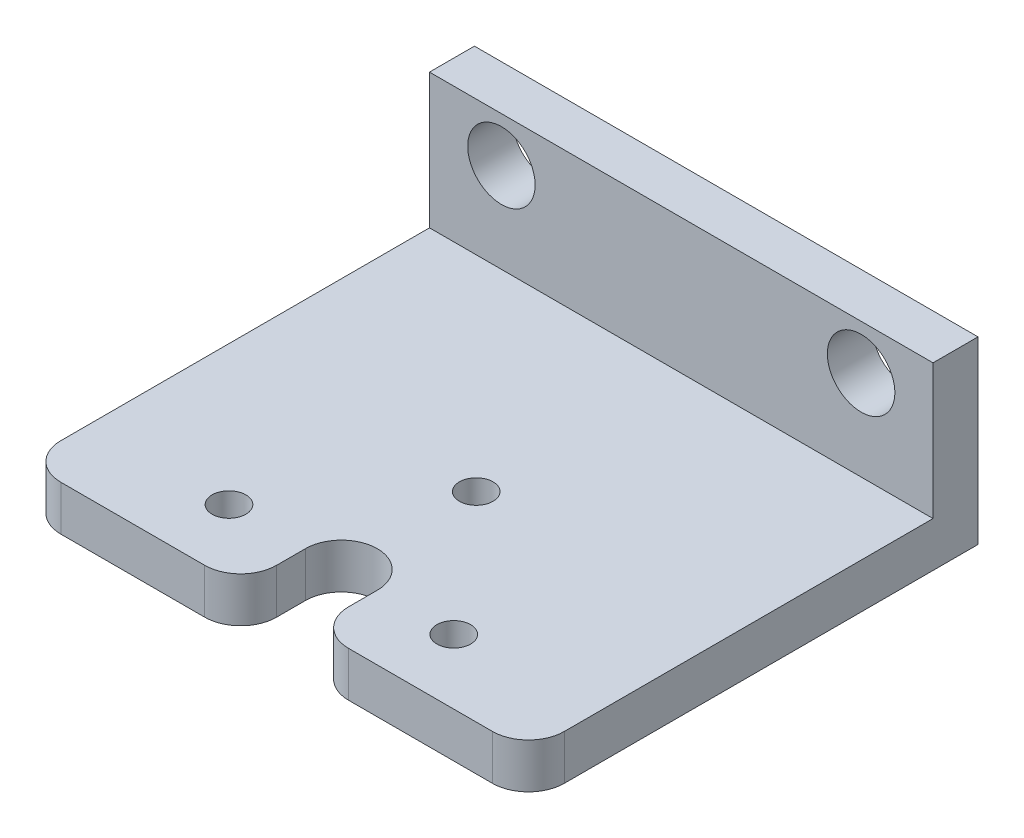
ISO-10303-21;
HEADER;
FILE_DESCRIPTION(('STEP AP214'),'2;1');
FILE_NAME('part.step','',(''),(''),'','','');
FILE_SCHEMA(('AUTOMOTIVE_DESIGN { 1 0 10303 214 1 1 1 1 }'));
ENDSEC;
DATA;
#1=APPLICATION_CONTEXT('core data for automotive mechanical design processes');
#2=APPLICATION_PROTOCOL_DEFINITION('international standard','automotive_design',2000,#1);
#3=PRODUCT_CONTEXT('',#1,'mechanical');
#4=PRODUCT('Part','Part','',(#3));
#5=PRODUCT_RELATED_PRODUCT_CATEGORY('part','',(#4));
#6=PRODUCT_DEFINITION_FORMATION('','',#4);
#7=PRODUCT_DEFINITION_CONTEXT('part definition',#1,'design');
#8=PRODUCT_DEFINITION('design','',#6,#7);
#9=PRODUCT_DEFINITION_SHAPE('','',#8);
#10=(LENGTH_UNIT() NAMED_UNIT(*) SI_UNIT(.MILLI.,.METRE.));
#11=(NAMED_UNIT(*) PLANE_ANGLE_UNIT() SI_UNIT($,.RADIAN.));
#12=(NAMED_UNIT(*) SI_UNIT($,.STERADIAN.) SOLID_ANGLE_UNIT());
#13=UNCERTAINTY_MEASURE_WITH_UNIT(LENGTH_MEASURE(1.E-05),#10,'distance_accuracy_value','');
#14=(GEOMETRIC_REPRESENTATION_CONTEXT(3) GLOBAL_UNCERTAINTY_ASSIGNED_CONTEXT((#13)) GLOBAL_UNIT_ASSIGNED_CONTEXT((#10,
#11,#12)) REPRESENTATION_CONTEXT('',''));
#15=CARTESIAN_POINT('',(0.,0.,0.));
#16=DIRECTION('',(0.,0.,1.));
#17=DIRECTION('',(1.,0.,0.));
#18=AXIS2_PLACEMENT_3D('',#15,#16,#17);
#19=CARTESIAN_POINT('',(0.,0.,31.75));
#20=DIRECTION('',(0.,0.,1.));
#21=DIRECTION('',(1.,0.,0.));
#22=AXIS2_PLACEMENT_3D('',#19,#20,#21);
#23=PLANE('',#22);
#24=DIRECTION('',(-1.,0.,0.));
#25=VECTOR('',#24,1.);
#26=CARTESIAN_POINT('',(-17.78,-3.17499999999999,31.75));
#27=LINE('',#26,#25);
#28=CARTESIAN_POINT('',(-5.08,-3.17499999999999,31.75));
#29=VERTEX_POINT('',#28);
#30=CARTESIAN_POINT('',(-15.24,-3.17499999999999,31.75));
#31=VERTEX_POINT('',#30);
#32=EDGE_CURVE('E174',#29,#31,#27,.T.);
#33=ORIENTED_EDGE('',*,*,#32,.T.);
#34=DIRECTION('',(0.,-1.,0.));
#35=VECTOR('',#34,1.);
#36=CARTESIAN_POINT('',(-15.24,-6.34999999999999,31.75));
#37=LINE('',#36,#35);
#38=CARTESIAN_POINT('',(-15.24,-6.34999999999999,31.75));
#39=VERTEX_POINT('',#38);
#40=EDGE_CURVE('E344',#31,#39,#37,.T.);
#41=ORIENTED_EDGE('',*,*,#40,.T.);
#42=DIRECTION('',(1.,0.,0.));
#43=VECTOR('',#42,1.);
#44=CARTESIAN_POINT('',(-17.78,-6.34999999999999,31.75));
#45=LINE('',#44,#43);
#46=CARTESIAN_POINT('',(-5.08,-6.34999999999999,31.75));
#47=VERTEX_POINT('',#46);
#48=EDGE_CURVE('E177',#39,#47,#45,.T.);
#49=ORIENTED_EDGE('',*,*,#48,.T.);
#50=DIRECTION('',(0.,-1.,0.));
#51=VECTOR('',#50,1.);
#52=CARTESIAN_POINT('',(-5.08,-3.17499999999999,31.75));
#53=LINE('',#52,#51);
#54=EDGE_CURVE('E347',#47,#29,#53,.F.);
#55=ORIENTED_EDGE('',*,*,#54,.T.);
#56=EDGE_LOOP('',(#33,#41,#49,#55));
#57=FACE_BOUND('',#56,.T.);
#58=ADVANCED_FACE('F35',(#57),#23,.T.);
#59=CARTESIAN_POINT('',(0.,0.,3.175));
#60=DIRECTION('',(0.,0.,1.));
#61=DIRECTION('',(1.,0.,0.));
#62=AXIS2_PLACEMENT_3D('',#59,#60,#61);
#63=PLANE('',#62);
#64=DIRECTION('',(-1.,0.,0.));
#65=VECTOR('',#64,1.);
#66=CARTESIAN_POINT('',(-17.78,-3.17499999999999,3.175));
#67=LINE('',#66,#65);
#68=CARTESIAN_POINT('',(17.78,-3.17499999999999,3.175));
#69=VERTEX_POINT('',#68);
#70=CARTESIAN_POINT('',(-17.78,-3.17499999999999,3.175));
#71=VERTEX_POINT('',#70);
#72=EDGE_CURVE('E170',#69,#71,#67,.T.);
#73=ORIENTED_EDGE('',*,*,#72,.F.);
#74=DIRECTION('',(0.,1.,0.));
#75=VECTOR('',#74,1.);
#76=CARTESIAN_POINT('',(17.78,6.35000000000001,3.175));
#77=LINE('',#76,#75);
#78=CARTESIAN_POINT('',(17.78,6.35000000000001,3.175));
#79=VERTEX_POINT('',#78);
#80=EDGE_CURVE('E307',#69,#79,#77,.T.);
#81=ORIENTED_EDGE('',*,*,#80,.T.);
#82=DIRECTION('',(-1.,0.,0.));
#83=VECTOR('',#82,1.);
#84=CARTESIAN_POINT('',(-17.78,6.35,3.175));
#85=LINE('',#84,#83);
#86=CARTESIAN_POINT('',(-17.78,6.35,3.175));
#87=VERTEX_POINT('',#86);
#88=EDGE_CURVE('E298',#79,#87,#85,.T.);
#89=ORIENTED_EDGE('',*,*,#88,.T.);
#90=DIRECTION('',(0.,-1.,0.));
#91=VECTOR('',#90,1.);
#92=CARTESIAN_POINT('',(-17.78,6.35,3.175));
#93=LINE('',#92,#91);
#94=EDGE_CURVE('E186',#87,#71,#93,.T.);
#95=ORIENTED_EDGE('',*,*,#94,.T.);
#96=EDGE_LOOP('',(#73,#81,#89,#95));
#97=FACE_BOUND('',#96,.T.);
#98=CARTESIAN_POINT('',(-12.7,3.175,3.175));
#99=DIRECTION('',(0.,0.,1.));
#100=DIRECTION('',(1.,0.,0.));
#101=AXIS2_PLACEMENT_3D('',#98,#99,#100);
#102=CIRCLE('',#101,2.38125);
#103=CARTESIAN_POINT('',(-10.31875,3.175,3.175));
#104=VERTEX_POINT('',#103);
#105=EDGE_CURVE('E319',#104,#104,#102,.T.);
#106=ORIENTED_EDGE('',*,*,#105,.F.);
#107=EDGE_LOOP('',(#106));
#108=FACE_BOUND('',#107,.T.);
#109=CARTESIAN_POINT('',(12.7,3.175,3.175));
#110=DIRECTION('',(0.,0.,1.));
#111=DIRECTION('',(-1.,0.,0.));
#112=AXIS2_PLACEMENT_3D('',#109,#110,#111);
#113=CIRCLE('',#112,2.38125);
#114=CARTESIAN_POINT('',(10.31875,3.175,3.175));
#115=VERTEX_POINT('',#114);
#116=EDGE_CURVE('E180',#115,#115,#113,.T.);
#117=ORIENTED_EDGE('',*,*,#116,.F.);
#118=EDGE_LOOP('',(#117));
#119=FACE_BOUND('',#118,.T.);
#120=ADVANCED_FACE('F253',(#97,#108,#119),#63,.T.);
#121=CARTESIAN_POINT('',(0.,0.,0.));
#122=DIRECTION('',(0.,0.,1.));
#123=DIRECTION('',(1.,0.,0.));
#124=AXIS2_PLACEMENT_3D('',#121,#122,#123);
#125=PLANE('',#124);
#126=DIRECTION('',(0.,1.,0.));
#127=VECTOR('',#126,1.);
#128=CARTESIAN_POINT('',(17.78,6.35000000000001,0.));
#129=LINE('',#128,#127);
#130=CARTESIAN_POINT('',(17.78,-6.34999999999999,0.));
#131=VERTEX_POINT('',#130);
#132=CARTESIAN_POINT('',(17.78,6.35000000000001,0.));
#133=VERTEX_POINT('',#132);
#134=EDGE_CURVE('E316',#131,#133,#129,.T.);
#135=ORIENTED_EDGE('',*,*,#134,.F.);
#136=DIRECTION('',(1.,0.,0.));
#137=VECTOR('',#136,1.);
#138=CARTESIAN_POINT('',(-17.78,-6.35,0.));
#139=LINE('',#138,#137);
#140=CARTESIAN_POINT('',(-17.78,-6.35,0.));
#141=VERTEX_POINT('',#140);
#142=EDGE_CURVE('E291',#141,#131,#139,.T.);
#143=ORIENTED_EDGE('',*,*,#142,.F.);
#144=DIRECTION('',(0.,-1.,0.));
#145=VECTOR('',#144,1.);
#146=CARTESIAN_POINT('',(-17.78,6.35,0.));
#147=LINE('',#146,#145);
#148=CARTESIAN_POINT('',(-17.78,6.35,0.));
#149=VERTEX_POINT('',#148);
#150=EDGE_CURVE('E320',#149,#141,#147,.T.);
#151=ORIENTED_EDGE('',*,*,#150,.F.);
#152=DIRECTION('',(-1.,0.,0.));
#153=VECTOR('',#152,1.);
#154=CARTESIAN_POINT('',(-17.78,6.35,0.));
#155=LINE('',#154,#153);
#156=EDGE_CURVE('E318',#133,#149,#155,.T.);
#157=ORIENTED_EDGE('',*,*,#156,.F.);
#158=EDGE_LOOP('',(#135,#143,#151,#157));
#159=FACE_BOUND('',#158,.T.);
#160=CARTESIAN_POINT('',(-12.7,3.175,0.));
#161=DIRECTION('',(0.,0.,1.));
#162=DIRECTION('',(1.,0.,0.));
#163=AXIS2_PLACEMENT_3D('',#160,#161,#162);
#164=CIRCLE('',#163,2.38125);
#165=CARTESIAN_POINT('',(-10.31875,3.175,0.));
#166=VERTEX_POINT('',#165);
#167=EDGE_CURVE('E312',#166,#166,#164,.T.);
#168=ORIENTED_EDGE('',*,*,#167,.T.);
#169=EDGE_LOOP('',(#168));
#170=FACE_BOUND('',#169,.T.);
#171=CARTESIAN_POINT('',(12.7,3.175,0.));
#172=DIRECTION('',(0.,0.,1.));
#173=DIRECTION('',(-1.,0.,0.));
#174=AXIS2_PLACEMENT_3D('',#171,#172,#173);
#175=CIRCLE('',#174,2.38125);
#176=CARTESIAN_POINT('',(10.31875,3.175,0.));
#177=VERTEX_POINT('',#176);
#178=EDGE_CURVE('E204',#177,#177,#175,.T.);
#179=ORIENTED_EDGE('',*,*,#178,.T.);
#180=EDGE_LOOP('',(#179));
#181=FACE_BOUND('',#180,.T.);
#182=ADVANCED_FACE('F260',(#159,#170,#181),#125,.F.);
#183=CARTESIAN_POINT('',(17.78,6.35000000000001,3.175));
#184=DIRECTION('',(-1.,0.,0.));
#185=DIRECTION('',(0.,-1.,0.));
#186=AXIS2_PLACEMENT_3D('',#183,#184,#185);
#187=PLANE('',#186);
#188=DIRECTION('',(0.,0.,-1.));
#189=VECTOR('',#188,1.);
#190=CARTESIAN_POINT('',(17.78,-3.17499999999999,31.75));
#191=LINE('',#190,#189);
#192=CARTESIAN_POINT('',(17.78,-3.17499999999999,29.21));
#193=VERTEX_POINT('',#192);
#194=EDGE_CURVE('E197',#193,#69,#191,.T.);
#195=ORIENTED_EDGE('',*,*,#194,.F.);
#196=DIRECTION('',(0.,1.,0.));
#197=VECTOR('',#196,1.);
#198=CARTESIAN_POINT('',(17.78,-6.34999999999999,29.21));
#199=LINE('',#198,#197);
#200=CARTESIAN_POINT('',(17.78,-6.34999999999999,29.21));
#201=VERTEX_POINT('',#200);
#202=EDGE_CURVE('E215',#193,#201,#199,.F.);
#203=ORIENTED_EDGE('',*,*,#202,.T.);
#204=DIRECTION('',(0.,0.,-1.));
#205=VECTOR('',#204,1.);
#206=CARTESIAN_POINT('',(17.78,-6.34999999999999,3.175));
#207=LINE('',#206,#205);
#208=EDGE_CURVE('E287',#201,#131,#207,.T.);
#209=ORIENTED_EDGE('',*,*,#208,.T.);
#210=ORIENTED_EDGE('',*,*,#134,.T.);
#211=DIRECTION('',(0.,0.,-1.));
#212=VECTOR('',#211,1.);
#213=CARTESIAN_POINT('',(17.78,6.35000000000001,3.175));
#214=LINE('',#213,#212);
#215=EDGE_CURVE('E304',#79,#133,#214,.T.);
#216=ORIENTED_EDGE('',*,*,#215,.F.);
#217=ORIENTED_EDGE('',*,*,#80,.F.);
#218=EDGE_LOOP('',(#195,#203,#209,#210,#216,#217));
#219=FACE_BOUND('',#218,.T.);
#220=ADVANCED_FACE('F285',(#219),#187,.F.);
#221=CARTESIAN_POINT('',(-17.78,6.35,3.175));
#222=DIRECTION('',(0.,-1.,0.));
#223=DIRECTION('',(1.,0.,0.));
#224=AXIS2_PLACEMENT_3D('',#221,#222,#223);
#225=PLANE('',#224);
#226=ORIENTED_EDGE('',*,*,#156,.T.);
#227=DIRECTION('',(0.,0.,-1.));
#228=VECTOR('',#227,1.);
#229=CARTESIAN_POINT('',(-17.78,6.35,3.175));
#230=LINE('',#229,#228);
#231=EDGE_CURVE('E295',#87,#149,#230,.T.);
#232=ORIENTED_EDGE('',*,*,#231,.F.);
#233=ORIENTED_EDGE('',*,*,#88,.F.);
#234=ORIENTED_EDGE('',*,*,#215,.T.);
#235=EDGE_LOOP('',(#226,#232,#233,#234));
#236=FACE_BOUND('',#235,.T.);
#237=ADVANCED_FACE('F334',(#236),#225,.F.);
#238=CARTESIAN_POINT('',(-17.78,6.35,3.175));
#239=DIRECTION('',(1.,0.,0.));
#240=DIRECTION('',(0.,1.,0.));
#241=AXIS2_PLACEMENT_3D('',#238,#239,#240);
#242=PLANE('',#241);
#243=DIRECTION('',(0.,0.,-1.));
#244=VECTOR('',#243,1.);
#245=CARTESIAN_POINT('',(-17.78,-6.35,3.175));
#246=LINE('',#245,#244);
#247=CARTESIAN_POINT('',(-17.78,-6.35,29.21));
#248=VERTEX_POINT('',#247);
#249=EDGE_CURVE('E293',#248,#141,#246,.T.);
#250=ORIENTED_EDGE('',*,*,#249,.F.);
#251=DIRECTION('',(0.,-1.,0.));
#252=VECTOR('',#251,1.);
#253=CARTESIAN_POINT('',(-17.78,-3.17499999999999,29.21));
#254=LINE('',#253,#252);
#255=CARTESIAN_POINT('',(-17.78,-3.17499999999999,29.21));
#256=VERTEX_POINT('',#255);
#257=EDGE_CURVE('E200',#248,#256,#254,.F.);
#258=ORIENTED_EDGE('',*,*,#257,.T.);
#259=DIRECTION('',(0.,0.,-1.));
#260=VECTOR('',#259,1.);
#261=CARTESIAN_POINT('',(-17.78,-3.17499999999999,31.75));
#262=LINE('',#261,#260);
#263=EDGE_CURVE('E194',#256,#71,#262,.T.);
#264=ORIENTED_EDGE('',*,*,#263,.T.);
#265=ORIENTED_EDGE('',*,*,#94,.F.);
#266=ORIENTED_EDGE('',*,*,#231,.T.);
#267=ORIENTED_EDGE('',*,*,#150,.T.);
#268=EDGE_LOOP('',(#250,#258,#264,#265,#266,#267));
#269=FACE_BOUND('',#268,.T.);
#270=ADVANCED_FACE('F325',(#269),#242,.F.);
#271=CARTESIAN_POINT('',(-17.78,-6.35,3.175));
#272=DIRECTION('',(0.,1.,0.));
#273=DIRECTION('',(-1.,0.,0.));
#274=AXIS2_PLACEMENT_3D('',#271,#272,#273);
#275=PLANE('',#274);
#276=CARTESIAN_POINT('',(7.9375,-6.34999999999999,27.178));
#277=DIRECTION('',(0.,1.,0.));
#278=DIRECTION('',(-1.,0.,0.));
#279=AXIS2_PLACEMENT_3D('',#276,#277,#278);
#280=CIRCLE('',#279,2.46062500000001);
#281=CARTESIAN_POINT('',(5.47687499999999,-6.34999999999999,27.178));
#282=VERTEX_POINT('',#281);
#283=EDGE_CURVE('E231',#282,#282,#280,.T.);
#284=ORIENTED_EDGE('',*,*,#283,.T.);
#285=EDGE_LOOP('',(#284));
#286=FACE_BOUND('',#285,.T.);
#287=CARTESIAN_POINT('',(0.,-6.34999999999999,17.653));
#288=DIRECTION('',(0.,1.,0.));
#289=DIRECTION('',(-1.,0.,0.));
#290=AXIS2_PLACEMENT_3D('',#287,#288,#289);
#291=CIRCLE('',#290,2.46062500000001);
#292=CARTESIAN_POINT('',(-2.46062500000001,-6.34999999999999,17.653));
#293=VERTEX_POINT('',#292);
#294=EDGE_CURVE('E228',#293,#293,#291,.T.);
#295=ORIENTED_EDGE('',*,*,#294,.T.);
#296=EDGE_LOOP('',(#295));
#297=FACE_BOUND('',#296,.T.);
#298=CARTESIAN_POINT('',(-7.9375,-6.34999999999999,27.178));
#299=DIRECTION('',(0.,1.,0.));
#300=DIRECTION('',(-1.,0.,0.));
#301=AXIS2_PLACEMENT_3D('',#298,#299,#300);
#302=CIRCLE('',#301,2.46062500000001);
#303=CARTESIAN_POINT('',(-10.398125,-6.34999999999999,27.178));
#304=VERTEX_POINT('',#303);
#305=EDGE_CURVE('E225',#304,#304,#302,.T.);
#306=ORIENTED_EDGE('',*,*,#305,.T.);
#307=EDGE_LOOP('',(#306));
#308=FACE_BOUND('',#307,.T.);
#309=ORIENTED_EDGE('',*,*,#48,.F.);
#310=CARTESIAN_POINT('',(-15.24,-6.35,29.21));
#311=DIRECTION('',(0.,1.,0.));
#312=DIRECTION('',(-1.,0.,0.));
#313=AXIS2_PLACEMENT_3D('',#310,#311,#312);
#314=CIRCLE('',#313,2.54);
#315=EDGE_CURVE('E198',#39,#248,#314,.F.);
#316=ORIENTED_EDGE('',*,*,#315,.T.);
#317=ORIENTED_EDGE('',*,*,#249,.T.);
#318=ORIENTED_EDGE('',*,*,#142,.T.);
#319=ORIENTED_EDGE('',*,*,#208,.F.);
#320=CARTESIAN_POINT('',(15.24,-6.34999999999999,29.21));
#321=DIRECTION('',(0.,1.,0.));
#322=DIRECTION('',(-1.,0.,0.));
#323=AXIS2_PLACEMENT_3D('',#320,#321,#322);
#324=CIRCLE('',#323,2.54);
#325=CARTESIAN_POINT('',(15.24,-6.34999999999999,31.75));
#326=VERTEX_POINT('',#325);
#327=EDGE_CURVE('E282',#201,#326,#324,.F.);
#328=ORIENTED_EDGE('',*,*,#327,.T.);
#329=CARTESIAN_POINT('',(5.08,-6.34999999999999,31.75));
#330=VERTEX_POINT('',#329);
#331=EDGE_CURVE('E173',#330,#326,#45,.T.);
#332=ORIENTED_EDGE('',*,*,#331,.F.);
#333=CARTESIAN_POINT('',(5.08,-6.34999999999999,29.21));
#334=DIRECTION('',(0.,1.,0.));
#335=DIRECTION('',(-1.,0.,0.));
#336=AXIS2_PLACEMENT_3D('',#333,#334,#335);
#337=CIRCLE('',#336,2.54);
#338=CARTESIAN_POINT('',(2.54,-6.34999999999999,29.21));
#339=VERTEX_POINT('',#338);
#340=EDGE_CURVE('E162',#330,#339,#337,.F.);
#341=ORIENTED_EDGE('',*,*,#340,.T.);
#342=DIRECTION('',(0.,0.,1.));
#343=VECTOR('',#342,1.);
#344=CARTESIAN_POINT('',(2.54,-6.34999999999999,48.2617809076499));
#345=LINE('',#344,#343);
#346=CARTESIAN_POINT('',(2.54,-6.34999999999999,27.178));
#347=VERTEX_POINT('',#346);
#348=EDGE_CURVE('E140',#347,#339,#345,.T.);
#349=ORIENTED_EDGE('',*,*,#348,.F.);
#350=CARTESIAN_POINT('',(0.,-6.34999999999999,27.178));
#351=DIRECTION('',(0.,-1.,0.));
#352=DIRECTION('',(1.,0.,0.));
#353=AXIS2_PLACEMENT_3D('',#350,#351,#352);
#354=CIRCLE('',#353,2.54);
#355=CARTESIAN_POINT('',(-2.54,-6.34999999999999,27.178));
#356=VERTEX_POINT('',#355);
#357=EDGE_CURVE('E151',#356,#347,#354,.T.);
#358=ORIENTED_EDGE('',*,*,#357,.F.);
#359=DIRECTION('',(0.,0.,-1.));
#360=VECTOR('',#359,1.);
#361=CARTESIAN_POINT('',(-2.54,-6.34999999999999,48.2617809076499));
#362=LINE('',#361,#360);
#363=CARTESIAN_POINT('',(-2.54,-6.34999999999999,29.21));
#364=VERTEX_POINT('',#363);
#365=EDGE_CURVE('E147',#364,#356,#362,.T.);
#366=ORIENTED_EDGE('',*,*,#365,.F.);
#367=CARTESIAN_POINT('',(-5.08,-6.34999999999999,29.21));
#368=DIRECTION('',(0.,1.,0.));
#369=DIRECTION('',(-1.,0.,0.));
#370=AXIS2_PLACEMENT_3D('',#367,#368,#369);
#371=CIRCLE('',#370,2.54);
#372=EDGE_CURVE('E346',#364,#47,#371,.F.);
#373=ORIENTED_EDGE('',*,*,#372,.T.);
#374=EDGE_LOOP('',(#309,#316,#317,#318,#319,#328,#332,#341,#349,#358,#366,#373));
#375=FACE_BOUND('',#374,.T.);
#376=ADVANCED_FACE('F159',(#286,#297,#308,#375),#275,.F.);
#377=CARTESIAN_POINT('',(-12.7,3.175,3.175));
#378=DIRECTION('',(0.,0.,-1.));
#379=DIRECTION('',(-1.,0.,0.));
#380=AXIS2_PLACEMENT_3D('',#377,#378,#379);
#381=CYLINDRICAL_SURFACE('',#380,2.38125);
#382=ORIENTED_EDGE('',*,*,#105,.T.);
#383=EDGE_LOOP('',(#382));
#384=FACE_BOUND('',#383,.T.);
#385=ORIENTED_EDGE('',*,*,#167,.F.);
#386=EDGE_LOOP('',(#385));
#387=FACE_BOUND('',#386,.T.);
#388=ADVANCED_FACE('F435',(#384,#387),#381,.F.);
#389=CARTESIAN_POINT('',(12.7,3.175,3.175));
#390=DIRECTION('',(0.,0.,-1.));
#391=DIRECTION('',(-1.,0.,0.));
#392=AXIS2_PLACEMENT_3D('',#389,#390,#391);
#393=CYLINDRICAL_SURFACE('',#392,2.38125);
#394=ORIENTED_EDGE('',*,*,#116,.T.);
#395=EDGE_LOOP('',(#394));
#396=FACE_BOUND('',#395,.T.);
#397=ORIENTED_EDGE('',*,*,#178,.F.);
#398=EDGE_LOOP('',(#397));
#399=FACE_BOUND('',#398,.T.);
#400=ADVANCED_FACE('F274',(#396,#399),#393,.F.);
#401=CARTESIAN_POINT('',(-17.78,-3.17499999999999,31.75));
#402=DIRECTION('',(0.,-1.,0.));
#403=DIRECTION('',(0.,0.,-1.));
#404=AXIS2_PLACEMENT_3D('',#401,#402,#403);
#405=PLANE('',#404);
#406=CARTESIAN_POINT('',(0.,-3.17499999999999,17.653));
#407=DIRECTION('',(0.,-1.,0.));
#408=DIRECTION('',(0.,0.,-1.));
#409=AXIS2_PLACEMENT_3D('',#406,#407,#408);
#410=CIRCLE('',#409,1.190625);
#411=CARTESIAN_POINT('',(0.,-3.17499999999999,16.462375));
#412=VERTEX_POINT('',#411);
#413=EDGE_CURVE('E573',#412,#412,#410,.T.);
#414=ORIENTED_EDGE('',*,*,#413,.T.);
#415=EDGE_LOOP('',(#414));
#416=FACE_BOUND('',#415,.T.);
#417=CARTESIAN_POINT('',(7.9375,-3.17499999999999,27.178));
#418=DIRECTION('',(0.,-1.,0.));
#419=DIRECTION('',(0.,0.,-1.));
#420=AXIS2_PLACEMENT_3D('',#417,#418,#419);
#421=CIRCLE('',#420,1.190625);
#422=CARTESIAN_POINT('',(7.9375,-3.17499999999999,25.987375));
#423=VERTEX_POINT('',#422);
#424=EDGE_CURVE('E570',#423,#423,#421,.T.);
#425=ORIENTED_EDGE('',*,*,#424,.T.);
#426=EDGE_LOOP('',(#425));
#427=FACE_BOUND('',#426,.T.);
#428=CARTESIAN_POINT('',(-7.9375,-3.17499999999999,27.178));
#429=DIRECTION('',(0.,-1.,0.));
#430=DIRECTION('',(0.,0.,-1.));
#431=AXIS2_PLACEMENT_3D('',#428,#429,#430);
#432=CIRCLE('',#431,1.190625);
#433=CARTESIAN_POINT('',(-7.9375,-3.17499999999999,25.987375));
#434=VERTEX_POINT('',#433);
#435=EDGE_CURVE('E156',#434,#434,#432,.T.);
#436=ORIENTED_EDGE('',*,*,#435,.T.);
#437=EDGE_LOOP('',(#436));
#438=FACE_BOUND('',#437,.T.);
#439=ORIENTED_EDGE('',*,*,#263,.F.);
#440=CARTESIAN_POINT('',(-15.24,-3.17499999999999,29.21));
#441=DIRECTION('',(0.,-1.,0.));
#442=DIRECTION('',(0.,0.,-1.));
#443=AXIS2_PLACEMENT_3D('',#440,#441,#442);
#444=CIRCLE('',#443,2.54);
#445=EDGE_CURVE('E208',#256,#31,#444,.F.);
#446=ORIENTED_EDGE('',*,*,#445,.T.);
#447=ORIENTED_EDGE('',*,*,#32,.F.);
#448=CARTESIAN_POINT('',(-5.08,-3.17499999999999,29.21));
#449=DIRECTION('',(0.,-1.,0.));
#450=DIRECTION('',(0.,0.,-1.));
#451=AXIS2_PLACEMENT_3D('',#448,#449,#450);
#452=CIRCLE('',#451,2.54);
#453=CARTESIAN_POINT('',(-2.54,-3.17499999999999,29.21));
#454=VERTEX_POINT('',#453);
#455=EDGE_CURVE('E202',#29,#454,#452,.F.);
#456=ORIENTED_EDGE('',*,*,#455,.T.);
#457=DIRECTION('',(0.,0.,-1.));
#458=VECTOR('',#457,1.);
#459=CARTESIAN_POINT('',(-2.54,-3.17499999999999,31.75));
#460=LINE('',#459,#458);
#461=CARTESIAN_POINT('',(-2.54,-3.17499999999999,27.178));
#462=VERTEX_POINT('',#461);
#463=EDGE_CURVE('E168',#454,#462,#460,.T.);
#464=ORIENTED_EDGE('',*,*,#463,.T.);
#465=CARTESIAN_POINT('',(0.,-3.17499999999999,27.178));
#466=DIRECTION('',(0.,-1.,0.));
#467=DIRECTION('',(0.,0.,-1.));
#468=AXIS2_PLACEMENT_3D('',#465,#466,#467);
#469=CIRCLE('',#468,2.54);
#470=CARTESIAN_POINT('',(2.54,-3.17499999999999,27.178));
#471=VERTEX_POINT('',#470);
#472=EDGE_CURVE('E306',#462,#471,#469,.T.);
#473=ORIENTED_EDGE('',*,*,#472,.T.);
#474=DIRECTION('',(0.,0.,1.));
#475=VECTOR('',#474,1.);
#476=CARTESIAN_POINT('',(2.54,-3.17499999999999,31.75));
#477=LINE('',#476,#475);
#478=CARTESIAN_POINT('',(2.54,-3.17499999999999,29.21));
#479=VERTEX_POINT('',#478);
#480=EDGE_CURVE('E142',#471,#479,#477,.T.);
#481=ORIENTED_EDGE('',*,*,#480,.T.);
#482=CARTESIAN_POINT('',(5.08,-3.17499999999999,29.21));
#483=DIRECTION('',(0.,-1.,0.));
#484=DIRECTION('',(0.,0.,-1.));
#485=AXIS2_PLACEMENT_3D('',#482,#483,#484);
#486=CIRCLE('',#485,2.54);
#487=CARTESIAN_POINT('',(5.08,-3.17499999999999,31.75));
#488=VERTEX_POINT('',#487);
#489=EDGE_CURVE('E56',#479,#488,#486,.F.);
#490=ORIENTED_EDGE('',*,*,#489,.T.);
#491=CARTESIAN_POINT('',(15.24,-3.17499999999999,31.75));
#492=VERTEX_POINT('',#491);
#493=EDGE_CURVE('E171',#492,#488,#27,.T.);
#494=ORIENTED_EDGE('',*,*,#493,.F.);
#495=CARTESIAN_POINT('',(15.24,-3.17499999999999,29.21));
#496=DIRECTION('',(0.,-1.,0.));
#497=DIRECTION('',(0.,0.,-1.));
#498=AXIS2_PLACEMENT_3D('',#495,#496,#497);
#499=CIRCLE('',#498,2.54);
#500=EDGE_CURVE('E50',#492,#193,#499,.F.);
#501=ORIENTED_EDGE('',*,*,#500,.T.);
#502=ORIENTED_EDGE('',*,*,#194,.T.);
#503=ORIENTED_EDGE('',*,*,#72,.T.);
#504=EDGE_LOOP('',(#439,#446,#447,#456,#464,#473,#481,#490,#494,#501,#502,#503));
#505=FACE_BOUND('',#504,.T.);
#506=ADVANCED_FACE('F267',(#416,#427,#438,#505),#405,.F.);
#507=ORIENTED_EDGE('',*,*,#331,.T.);
#508=DIRECTION('',(0.,1.,0.));
#509=VECTOR('',#508,1.);
#510=CARTESIAN_POINT('',(15.24,-3.17499999999999,31.75));
#511=LINE('',#510,#509);
#512=EDGE_CURVE('E212',#326,#492,#511,.T.);
#513=ORIENTED_EDGE('',*,*,#512,.T.);
#514=ORIENTED_EDGE('',*,*,#493,.T.);
#515=DIRECTION('',(0.,1.,0.));
#516=VECTOR('',#515,1.);
#517=CARTESIAN_POINT('',(5.08,-6.34999999999999,31.75));
#518=LINE('',#517,#516);
#519=EDGE_CURVE('E210',#488,#330,#518,.F.);
#520=ORIENTED_EDGE('',*,*,#519,.T.);
#521=EDGE_LOOP('',(#507,#513,#514,#520));
#522=FACE_BOUND('',#521,.T.);
#523=ADVANCED_FACE('F256',(#522),#23,.T.);
#524=CARTESIAN_POINT('',(0.,6.35002500000001,27.178));
#525=DIRECTION('',(0.,-1.,0.));
#526=DIRECTION('',(1.,0.,0.));
#527=AXIS2_PLACEMENT_3D('',#524,#525,#526);
#528=CYLINDRICAL_SURFACE('',#527,2.54);
#529=DIRECTION('',(0.,-1.,0.));
#530=VECTOR('',#529,1.);
#531=CARTESIAN_POINT('',(-2.54,6.35002500000001,27.178));
#532=LINE('',#531,#530);
#533=EDGE_CURVE('E146',#462,#356,#532,.T.);
#534=ORIENTED_EDGE('',*,*,#533,.T.);
#535=ORIENTED_EDGE('',*,*,#357,.T.);
#536=DIRECTION('',(0.,-1.,0.));
#537=VECTOR('',#536,1.);
#538=CARTESIAN_POINT('',(2.54,6.35002500000001,27.178));
#539=LINE('',#538,#537);
#540=EDGE_CURVE('E135',#471,#347,#539,.T.);
#541=ORIENTED_EDGE('',*,*,#540,.F.);
#542=ORIENTED_EDGE('',*,*,#472,.F.);
#543=EDGE_LOOP('',(#534,#535,#541,#542));
#544=FACE_BOUND('',#543,.T.);
#545=ADVANCED_FACE('F152',(#544),#528,.F.);
#546=CARTESIAN_POINT('',(-2.54,6.35002500000001,48.2617809076499));
#547=DIRECTION('',(-1.,0.,0.));
#548=DIRECTION('',(0.,0.,1.));
#549=AXIS2_PLACEMENT_3D('',#546,#547,#548);
#550=PLANE('',#549);
#551=ORIENTED_EDGE('',*,*,#463,.F.);
#552=DIRECTION('',(0.,-1.,0.));
#553=VECTOR('',#552,1.);
#554=CARTESIAN_POINT('',(-2.54,-6.34999999999999,29.21));
#555=LINE('',#554,#553);
#556=EDGE_CURVE('E219',#454,#364,#555,.T.);
#557=ORIENTED_EDGE('',*,*,#556,.T.);
#558=ORIENTED_EDGE('',*,*,#365,.T.);
#559=ORIENTED_EDGE('',*,*,#533,.F.);
#560=EDGE_LOOP('',(#551,#557,#558,#559));
#561=FACE_BOUND('',#560,.T.);
#562=ADVANCED_FACE('F273',(#561),#550,.F.);
#563=CARTESIAN_POINT('',(2.54,6.35002500000001,48.2617809076499));
#564=DIRECTION('',(1.,0.,0.));
#565=DIRECTION('',(0.,0.,-1.));
#566=AXIS2_PLACEMENT_3D('',#563,#564,#565);
#567=PLANE('',#566);
#568=ORIENTED_EDGE('',*,*,#348,.T.);
#569=DIRECTION('',(0.,1.,0.));
#570=VECTOR('',#569,1.);
#571=CARTESIAN_POINT('',(2.54,-3.17499999999999,29.21));
#572=LINE('',#571,#570);
#573=EDGE_CURVE('E217',#339,#479,#572,.T.);
#574=ORIENTED_EDGE('',*,*,#573,.T.);
#575=ORIENTED_EDGE('',*,*,#480,.F.);
#576=ORIENTED_EDGE('',*,*,#540,.T.);
#577=EDGE_LOOP('',(#568,#574,#575,#576));
#578=FACE_BOUND('',#577,.T.);
#579=ADVANCED_FACE('F137',(#578),#567,.F.);
#580=CARTESIAN_POINT('',(-7.9375,6.35002500000001,27.178));
#581=DIRECTION('',(0.,-1.,0.));
#582=DIRECTION('',(1.,0.,0.));
#583=AXIS2_PLACEMENT_3D('',#580,#581,#582);
#584=CYLINDRICAL_SURFACE('',#583,1.190625);
#585=CARTESIAN_POINT('',(-7.9375,-5.07999999999999,27.178));
#586=DIRECTION('',(0.,1.,0.));
#587=DIRECTION('',(0.,0.,1.));
#588=AXIS2_PLACEMENT_3D('',#585,#586,#587);
#589=CIRCLE('',#588,1.190625);
#590=CARTESIAN_POINT('',(-7.9375,-5.07999999999999,28.368625));
#591=VERTEX_POINT('',#590);
#592=EDGE_CURVE('E11',#591,#591,#589,.F.);
#593=ORIENTED_EDGE('',*,*,#592,.T.);
#594=EDGE_LOOP('',(#593));
#595=FACE_BOUND('',#594,.T.);
#596=ORIENTED_EDGE('',*,*,#435,.F.);
#597=EDGE_LOOP('',(#596));
#598=FACE_BOUND('',#597,.T.);
#599=ADVANCED_FACE('F364',(#595,#598),#584,.F.);
#600=CARTESIAN_POINT('',(7.9375,6.35002500000001,27.178));
#601=DIRECTION('',(0.,-1.,0.));
#602=DIRECTION('',(1.,0.,0.));
#603=AXIS2_PLACEMENT_3D('',#600,#601,#602);
#604=CYLINDRICAL_SURFACE('',#603,1.190625);
#605=CARTESIAN_POINT('',(7.9375,-5.07999999999999,27.178));
#606=DIRECTION('',(0.,1.,0.));
#607=DIRECTION('',(0.,0.,1.));
#608=AXIS2_PLACEMENT_3D('',#605,#606,#607);
#609=CIRCLE('',#608,1.190625);
#610=CARTESIAN_POINT('',(7.9375,-5.07999999999999,28.368625));
#611=VERTEX_POINT('',#610);
#612=EDGE_CURVE('E222',#611,#611,#609,.F.);
#613=ORIENTED_EDGE('',*,*,#612,.T.);
#614=EDGE_LOOP('',(#613));
#615=FACE_BOUND('',#614,.T.);
#616=ORIENTED_EDGE('',*,*,#424,.F.);
#617=EDGE_LOOP('',(#616));
#618=FACE_BOUND('',#617,.T.);
#619=ADVANCED_FACE('F369',(#615,#618),#604,.F.);
#620=CARTESIAN_POINT('',(0.,6.35002500000001,17.653));
#621=DIRECTION('',(0.,-1.,0.));
#622=DIRECTION('',(1.,0.,0.));
#623=AXIS2_PLACEMENT_3D('',#620,#621,#622);
#624=CYLINDRICAL_SURFACE('',#623,1.190625);
#625=CARTESIAN_POINT('',(0.,-5.07999999999999,17.653));
#626=DIRECTION('',(0.,1.,0.));
#627=DIRECTION('',(-1.,0.,0.));
#628=AXIS2_PLACEMENT_3D('',#625,#626,#627);
#629=CIRCLE('',#628,1.190625);
#630=CARTESIAN_POINT('',(-1.190625,-5.07999999999999,17.653));
#631=VERTEX_POINT('',#630);
#632=EDGE_CURVE('E43',#631,#631,#629,.F.);
#633=ORIENTED_EDGE('',*,*,#632,.T.);
#634=EDGE_LOOP('',(#633));
#635=FACE_BOUND('',#634,.T.);
#636=ORIENTED_EDGE('',*,*,#413,.F.);
#637=EDGE_LOOP('',(#636));
#638=FACE_BOUND('',#637,.T.);
#639=ADVANCED_FACE('F236',(#635,#638),#624,.F.);
#640=CARTESIAN_POINT('',(-15.24,0.,29.21));
#641=DIRECTION('',(0.,1.,0.));
#642=DIRECTION('',(-1.,0.,0.));
#643=AXIS2_PLACEMENT_3D('',#640,#641,#642);
#644=CYLINDRICAL_SURFACE('',#643,2.54);
#645=ORIENTED_EDGE('',*,*,#445,.F.);
#646=ORIENTED_EDGE('',*,*,#257,.F.);
#647=ORIENTED_EDGE('',*,*,#315,.F.);
#648=ORIENTED_EDGE('',*,*,#40,.F.);
#649=EDGE_LOOP('',(#645,#646,#647,#648));
#650=FACE_BOUND('',#649,.T.);
#651=ADVANCED_FACE('F342',(#650),#644,.T.);
#652=CARTESIAN_POINT('',(15.24,0.,29.21));
#653=DIRECTION('',(0.,-1.,0.));
#654=DIRECTION('',(1.,0.,0.));
#655=AXIS2_PLACEMENT_3D('',#652,#653,#654);
#656=CYLINDRICAL_SURFACE('',#655,2.54);
#657=ORIENTED_EDGE('',*,*,#327,.F.);
#658=ORIENTED_EDGE('',*,*,#202,.F.);
#659=ORIENTED_EDGE('',*,*,#500,.F.);
#660=ORIENTED_EDGE('',*,*,#512,.F.);
#661=EDGE_LOOP('',(#657,#658,#659,#660));
#662=FACE_BOUND('',#661,.T.);
#663=ADVANCED_FACE('F280',(#662),#656,.T.);
#664=CARTESIAN_POINT('',(5.08,6.35002500000001,29.21));
#665=DIRECTION('',(0.,-1.,0.));
#666=DIRECTION('',(1.,0.,0.));
#667=AXIS2_PLACEMENT_3D('',#664,#665,#666);
#668=CYLINDRICAL_SURFACE('',#667,2.54);
#669=ORIENTED_EDGE('',*,*,#340,.F.);
#670=ORIENTED_EDGE('',*,*,#519,.F.);
#671=ORIENTED_EDGE('',*,*,#489,.F.);
#672=ORIENTED_EDGE('',*,*,#573,.F.);
#673=EDGE_LOOP('',(#669,#670,#671,#672));
#674=FACE_BOUND('',#673,.T.);
#675=ADVANCED_FACE('F382',(#674),#668,.T.);
#676=CARTESIAN_POINT('',(-5.08,6.35002500000001,29.21));
#677=DIRECTION('',(0.,1.,0.));
#678=DIRECTION('',(-1.,0.,0.));
#679=AXIS2_PLACEMENT_3D('',#676,#677,#678);
#680=CYLINDRICAL_SURFACE('',#679,2.54);
#681=ORIENTED_EDGE('',*,*,#455,.F.);
#682=ORIENTED_EDGE('',*,*,#54,.F.);
#683=ORIENTED_EDGE('',*,*,#372,.F.);
#684=ORIENTED_EDGE('',*,*,#556,.F.);
#685=EDGE_LOOP('',(#681,#682,#683,#684));
#686=FACE_BOUND('',#685,.T.);
#687=ADVANCED_FACE('F248',(#686),#680,.T.);
#688=CARTESIAN_POINT('',(7.9375,-5.07999999999999,27.178));
#689=DIRECTION('',(0.,-1.,0.));
#690=DIRECTION('',(0.,0.,-1.));
#691=AXIS2_PLACEMENT_3D('',#688,#689,#690);
#692=CONICAL_SURFACE('',#691,1.190625,0.78539816339745);
#693=ORIENTED_EDGE('',*,*,#283,.F.);
#694=EDGE_LOOP('',(#693));
#695=FACE_BOUND('',#694,.T.);
#696=ORIENTED_EDGE('',*,*,#612,.F.);
#697=EDGE_LOOP('',(#696));
#698=FACE_BOUND('',#697,.T.);
#699=ADVANCED_FACE('F241',(#695,#698),#692,.F.);
#700=CARTESIAN_POINT('',(0.,-5.07999999999999,17.653));
#701=DIRECTION('',(0.,-1.,0.));
#702=DIRECTION('',(1.,0.,0.));
#703=AXIS2_PLACEMENT_3D('',#700,#701,#702);
#704=CONICAL_SURFACE('',#703,1.190625,0.78539816339745);
#705=ORIENTED_EDGE('',*,*,#294,.F.);
#706=EDGE_LOOP('',(#705));
#707=FACE_BOUND('',#706,.T.);
#708=ORIENTED_EDGE('',*,*,#632,.F.);
#709=EDGE_LOOP('',(#708));
#710=FACE_BOUND('',#709,.T.);
#711=ADVANCED_FACE('F239',(#707,#710),#704,.F.);
#712=CARTESIAN_POINT('',(-7.9375,-5.07999999999999,27.178));
#713=DIRECTION('',(0.,-1.,0.));
#714=DIRECTION('',(0.,0.,-1.));
#715=AXIS2_PLACEMENT_3D('',#712,#713,#714);
#716=CONICAL_SURFACE('',#715,1.190625,0.78539816339745);
#717=ORIENTED_EDGE('',*,*,#305,.F.);
#718=EDGE_LOOP('',(#717));
#719=FACE_BOUND('',#718,.T.);
#720=ORIENTED_EDGE('',*,*,#592,.F.);
#721=EDGE_LOOP('',(#720));
#722=FACE_BOUND('',#721,.T.);
#723=ADVANCED_FACE('F37',(#719,#722),#716,.F.);
#724=CLOSED_SHELL('',(#58,#120,#182,#220,#237,#270,#376,#388,#400,#506,#523,#545,#562,#579,#599,
#619,#639,#651,#663,#675,#687,#699,#711,#723));
#725=MANIFOLD_SOLID_BREP('B2',#724);
#726=ADVANCED_BREP_SHAPE_REPRESENTATION('',(#18,#725),#14);
#727=SHAPE_DEFINITION_REPRESENTATION(#9,#726);
ENDSEC;
END-ISO-10303-21;
